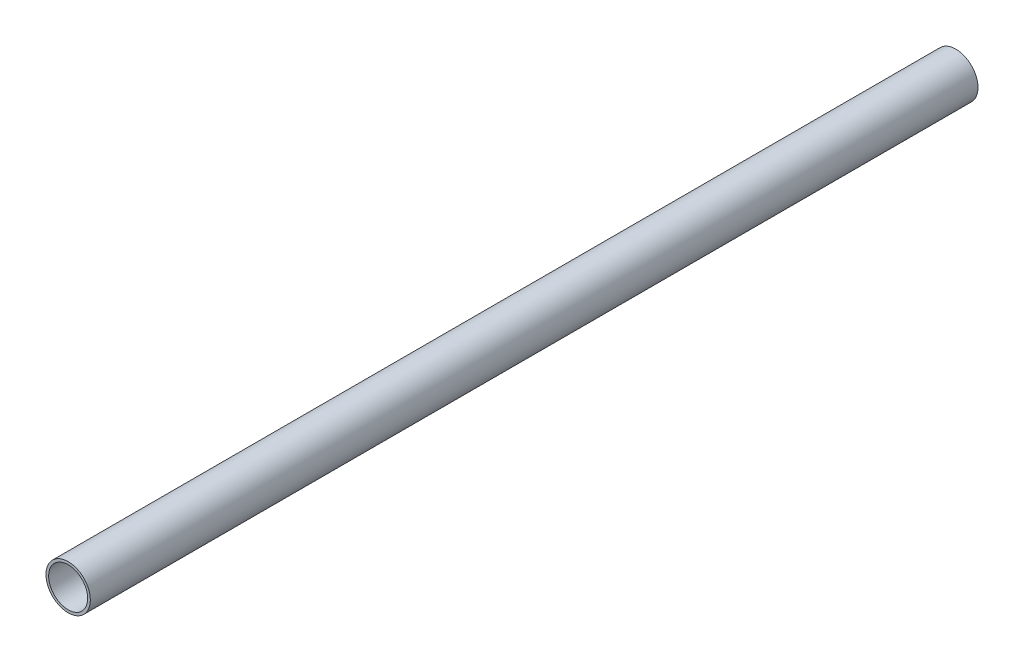
ISO-10303-21;
HEADER;
FILE_DESCRIPTION(('STEP AP214'),'2;1');
FILE_NAME('part.step','',(''),(''),'','','');
FILE_SCHEMA(('AUTOMOTIVE_DESIGN { 1 0 10303 214 1 1 1 1 }'));
ENDSEC;
DATA;
#1=APPLICATION_CONTEXT('core data for automotive mechanical design processes');
#2=APPLICATION_PROTOCOL_DEFINITION('international standard','automotive_design',2000,#1);
#3=PRODUCT_CONTEXT('',#1,'mechanical');
#4=PRODUCT('Part','Part','',(#3));
#5=PRODUCT_RELATED_PRODUCT_CATEGORY('part','',(#4));
#6=PRODUCT_DEFINITION_FORMATION('','',#4);
#7=PRODUCT_DEFINITION_CONTEXT('part definition',#1,'design');
#8=PRODUCT_DEFINITION('design','',#6,#7);
#9=PRODUCT_DEFINITION_SHAPE('','',#8);
#10=(LENGTH_UNIT() NAMED_UNIT(*) SI_UNIT(.MILLI.,.METRE.));
#11=(NAMED_UNIT(*) PLANE_ANGLE_UNIT() SI_UNIT($,.RADIAN.));
#12=(NAMED_UNIT(*) SI_UNIT($,.STERADIAN.) SOLID_ANGLE_UNIT());
#13=UNCERTAINTY_MEASURE_WITH_UNIT(LENGTH_MEASURE(1.E-05),#10,'distance_accuracy_value','');
#14=(GEOMETRIC_REPRESENTATION_CONTEXT(3) GLOBAL_UNCERTAINTY_ASSIGNED_CONTEXT((#13)) GLOBAL_UNIT_ASSIGNED_CONTEXT((#10,
#11,#12)) REPRESENTATION_CONTEXT('',''));
#15=CARTESIAN_POINT('',(0.,0.,0.));
#16=DIRECTION('',(0.,0.,1.));
#17=DIRECTION('',(1.,0.,0.));
#18=AXIS2_PLACEMENT_3D('',#15,#16,#17);
#19=CARTESIAN_POINT('',(0.,0.,1000.));
#20=DIRECTION('',(0.,0.,1.));
#21=DIRECTION('',(1.,0.,0.));
#22=AXIS2_PLACEMENT_3D('',#19,#20,#21);
#23=PLANE('',#22);
#24=CARTESIAN_POINT('',(0.,0.,1000.));
#25=DIRECTION('',(0.,0.,1.));
#26=DIRECTION('',(1.,0.,0.));
#27=AXIS2_PLACEMENT_3D('',#24,#25,#26);
#28=CIRCLE('',#27,25.);
#29=CARTESIAN_POINT('',(25.,0.,1000.));
#30=VERTEX_POINT('',#29);
#31=EDGE_CURVE('E10',#30,#30,#28,.T.);
#32=ORIENTED_EDGE('',*,*,#31,.T.);
#33=EDGE_LOOP('',(#32));
#34=FACE_BOUND('',#33,.T.);
#35=CARTESIAN_POINT('',(0.,0.,1000.));
#36=DIRECTION('',(0.,0.,1.));
#37=DIRECTION('',(1.,0.,0.));
#38=AXIS2_PLACEMENT_3D('',#35,#36,#37);
#39=CIRCLE('',#38,22.);
#40=CARTESIAN_POINT('',(22.,0.,1000.));
#41=VERTEX_POINT('',#40);
#42=EDGE_CURVE('E45',#41,#41,#39,.T.);
#43=ORIENTED_EDGE('',*,*,#42,.F.);
#44=EDGE_LOOP('',(#43));
#45=FACE_BOUND('',#44,.T.);
#46=ADVANCED_FACE('F34',(#34,#45),#23,.T.);
#47=CARTESIAN_POINT('',(0.,0.,0.));
#48=DIRECTION('',(0.,0.,1.));
#49=DIRECTION('',(1.,0.,0.));
#50=AXIS2_PLACEMENT_3D('',#47,#48,#49);
#51=PLANE('',#50);
#52=CARTESIAN_POINT('',(0.,0.,0.));
#53=DIRECTION('',(0.,0.,1.));
#54=DIRECTION('',(1.,0.,0.));
#55=AXIS2_PLACEMENT_3D('',#52,#53,#54);
#56=CIRCLE('',#55,25.);
#57=CARTESIAN_POINT('',(25.,0.,0.));
#58=VERTEX_POINT('',#57);
#59=EDGE_CURVE('E38',#58,#58,#56,.T.);
#60=ORIENTED_EDGE('',*,*,#59,.F.);
#61=EDGE_LOOP('',(#60));
#62=FACE_BOUND('',#61,.T.);
#63=CARTESIAN_POINT('',(0.,0.,0.));
#64=DIRECTION('',(0.,0.,1.));
#65=DIRECTION('',(1.,0.,0.));
#66=AXIS2_PLACEMENT_3D('',#63,#64,#65);
#67=CIRCLE('',#66,22.);
#68=CARTESIAN_POINT('',(22.,0.,0.));
#69=VERTEX_POINT('',#68);
#70=EDGE_CURVE('E47',#69,#69,#67,.T.);
#71=ORIENTED_EDGE('',*,*,#70,.T.);
#72=EDGE_LOOP('',(#71));
#73=FACE_BOUND('',#72,.T.);
#74=ADVANCED_FACE('F57',(#62,#73),#51,.F.);
#75=CARTESIAN_POINT('',(0.,0.,1000.));
#76=DIRECTION('',(0.,0.,-1.));
#77=DIRECTION('',(-1.,0.,0.));
#78=AXIS2_PLACEMENT_3D('',#75,#76,#77);
#79=CYLINDRICAL_SURFACE('',#78,25.);
#80=ORIENTED_EDGE('',*,*,#31,.F.);
#81=EDGE_LOOP('',(#80));
#82=FACE_BOUND('',#81,.T.);
#83=ORIENTED_EDGE('',*,*,#59,.T.);
#84=EDGE_LOOP('',(#83));
#85=FACE_BOUND('',#84,.T.);
#86=ADVANCED_FACE('F36',(#82,#85),#79,.T.);
#87=CARTESIAN_POINT('',(0.,0.,1000.));
#88=DIRECTION('',(0.,0.,-1.));
#89=DIRECTION('',(-1.,0.,0.));
#90=AXIS2_PLACEMENT_3D('',#87,#88,#89);
#91=CYLINDRICAL_SURFACE('',#90,22.);
#92=ORIENTED_EDGE('',*,*,#42,.T.);
#93=EDGE_LOOP('',(#92));
#94=FACE_BOUND('',#93,.T.);
#95=ORIENTED_EDGE('',*,*,#70,.F.);
#96=EDGE_LOOP('',(#95));
#97=FACE_BOUND('',#96,.T.);
#98=ADVANCED_FACE('F53',(#94,#97),#91,.F.);
#99=CLOSED_SHELL('',(#46,#74,#86,#98));
#100=MANIFOLD_SOLID_BREP('B2',#99);
#101=ADVANCED_BREP_SHAPE_REPRESENTATION('',(#18,#100),#14);
#102=SHAPE_DEFINITION_REPRESENTATION(#9,#101);
ENDSEC;
END-ISO-10303-21;
